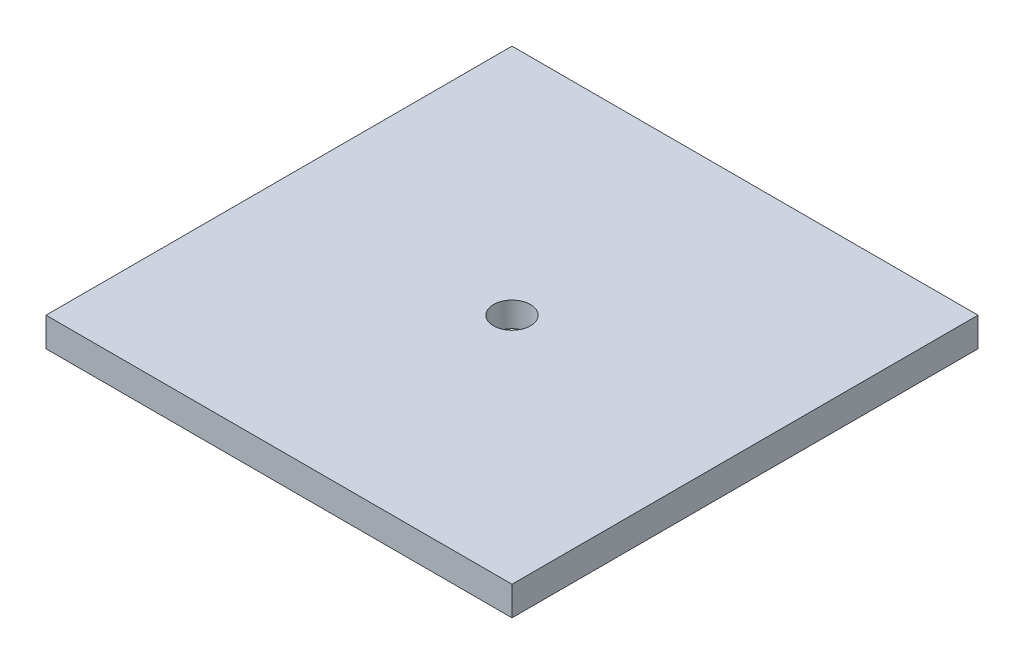
ISO-10303-21;
HEADER;
FILE_DESCRIPTION(('STEP AP214'),'2;1');
FILE_NAME('part.step','',(''),(''),'','','');
FILE_SCHEMA(('AUTOMOTIVE_DESIGN { 1 0 10303 214 1 1 1 1 }'));
ENDSEC;
DATA;
#1=APPLICATION_CONTEXT('core data for automotive mechanical design processes');
#2=APPLICATION_PROTOCOL_DEFINITION('international standard','automotive_design',2000,#1);
#3=PRODUCT_CONTEXT('',#1,'mechanical');
#4=PRODUCT('Part','Part','',(#3));
#5=PRODUCT_RELATED_PRODUCT_CATEGORY('part','',(#4));
#6=PRODUCT_DEFINITION_FORMATION('','',#4);
#7=PRODUCT_DEFINITION_CONTEXT('part definition',#1,'design');
#8=PRODUCT_DEFINITION('design','',#6,#7);
#9=PRODUCT_DEFINITION_SHAPE('','',#8);
#10=(LENGTH_UNIT() NAMED_UNIT(*) SI_UNIT(.MILLI.,.METRE.));
#11=(NAMED_UNIT(*) PLANE_ANGLE_UNIT() SI_UNIT($,.RADIAN.));
#12=(NAMED_UNIT(*) SI_UNIT($,.STERADIAN.) SOLID_ANGLE_UNIT());
#13=UNCERTAINTY_MEASURE_WITH_UNIT(LENGTH_MEASURE(1.E-05),#10,'distance_accuracy_value','');
#14=(GEOMETRIC_REPRESENTATION_CONTEXT(3) GLOBAL_UNCERTAINTY_ASSIGNED_CONTEXT((#13)) GLOBAL_UNIT_ASSIGNED_CONTEXT((#10,
#11,#12)) REPRESENTATION_CONTEXT('',''));
#15=CARTESIAN_POINT('',(0.,0.,0.));
#16=DIRECTION('',(0.,0.,1.));
#17=DIRECTION('',(1.,0.,0.));
#18=AXIS2_PLACEMENT_3D('',#15,#16,#17);
#19=CARTESIAN_POINT('',(101.6,12.7,-101.6));
#20=DIRECTION('',(-1.,0.,0.));
#21=DIRECTION('',(0.,0.,1.));
#22=AXIS2_PLACEMENT_3D('',#19,#20,#21);
#23=PLANE('',#22);
#24=DIRECTION('',(0.,0.,-1.));
#25=VECTOR('',#24,1.);
#26=CARTESIAN_POINT('',(101.6,0.,-101.6));
#27=LINE('',#26,#25);
#28=CARTESIAN_POINT('',(101.6,0.,101.6));
#29=VERTEX_POINT('',#28);
#30=CARTESIAN_POINT('',(101.6,0.,-101.6));
#31=VERTEX_POINT('',#30);
#32=EDGE_CURVE('E111',#29,#31,#27,.T.);
#33=ORIENTED_EDGE('',*,*,#32,.T.);
#34=DIRECTION('',(0.,-1.,0.));
#35=VECTOR('',#34,1.);
#36=CARTESIAN_POINT('',(101.6,12.7,-101.6));
#37=LINE('',#36,#35);
#38=CARTESIAN_POINT('',(101.6,12.7,-101.6));
#39=VERTEX_POINT('',#38);
#40=EDGE_CURVE('E11',#39,#31,#37,.T.);
#41=ORIENTED_EDGE('',*,*,#40,.F.);
#42=DIRECTION('',(0.,0.,-1.));
#43=VECTOR('',#42,1.);
#44=CARTESIAN_POINT('',(101.6,12.7,-101.6));
#45=LINE('',#44,#43);
#46=CARTESIAN_POINT('',(101.6,12.7,101.6));
#47=VERTEX_POINT('',#46);
#48=EDGE_CURVE('E95',#47,#39,#45,.T.);
#49=ORIENTED_EDGE('',*,*,#48,.F.);
#50=DIRECTION('',(0.,-1.,0.));
#51=VECTOR('',#50,1.);
#52=CARTESIAN_POINT('',(101.6,12.7,101.6));
#53=LINE('',#52,#51);
#54=EDGE_CURVE('E107',#47,#29,#53,.T.);
#55=ORIENTED_EDGE('',*,*,#54,.T.);
#56=EDGE_LOOP('',(#33,#41,#49,#55));
#57=FACE_BOUND('',#56,.T.);
#58=ADVANCED_FACE('F43',(#57),#23,.F.);
#59=CARTESIAN_POINT('',(-101.6,12.7,-101.6));
#60=DIRECTION('',(0.,0.,1.));
#61=DIRECTION('',(1.,0.,0.));
#62=AXIS2_PLACEMENT_3D('',#59,#60,#61);
#63=PLANE('',#62);
#64=DIRECTION('',(-1.,0.,0.));
#65=VECTOR('',#64,1.);
#66=CARTESIAN_POINT('',(-101.6,0.,-101.6));
#67=LINE('',#66,#65);
#68=CARTESIAN_POINT('',(-101.6,0.,-101.6));
#69=VERTEX_POINT('',#68);
#70=EDGE_CURVE('E100',#31,#69,#67,.T.);
#71=ORIENTED_EDGE('',*,*,#70,.T.);
#72=DIRECTION('',(0.,-1.,0.));
#73=VECTOR('',#72,1.);
#74=CARTESIAN_POINT('',(-101.6,12.7,-101.6));
#75=LINE('',#74,#73);
#76=CARTESIAN_POINT('',(-101.6,12.7,-101.6));
#77=VERTEX_POINT('',#76);
#78=EDGE_CURVE('E52',#77,#69,#75,.T.);
#79=ORIENTED_EDGE('',*,*,#78,.F.);
#80=DIRECTION('',(-1.,0.,0.));
#81=VECTOR('',#80,1.);
#82=CARTESIAN_POINT('',(-101.6,12.7,-101.6));
#83=LINE('',#82,#81);
#84=EDGE_CURVE('E90',#39,#77,#83,.T.);
#85=ORIENTED_EDGE('',*,*,#84,.F.);
#86=ORIENTED_EDGE('',*,*,#40,.T.);
#87=EDGE_LOOP('',(#71,#79,#85,#86));
#88=FACE_BOUND('',#87,.T.);
#89=ADVANCED_FACE('F99',(#88),#63,.F.);
#90=CARTESIAN_POINT('',(-101.6,12.7,-101.6));
#91=DIRECTION('',(1.,0.,0.));
#92=DIRECTION('',(0.,0.,-1.));
#93=AXIS2_PLACEMENT_3D('',#90,#91,#92);
#94=PLANE('',#93);
#95=DIRECTION('',(0.,0.,1.));
#96=VECTOR('',#95,1.);
#97=CARTESIAN_POINT('',(-101.6,0.,-101.6));
#98=LINE('',#97,#96);
#99=CARTESIAN_POINT('',(-101.6,0.,101.6));
#100=VERTEX_POINT('',#99);
#101=EDGE_CURVE('E77',#69,#100,#98,.T.);
#102=ORIENTED_EDGE('',*,*,#101,.T.);
#103=DIRECTION('',(0.,-1.,0.));
#104=VECTOR('',#103,1.);
#105=CARTESIAN_POINT('',(-101.6,12.7,101.6));
#106=LINE('',#105,#104);
#107=CARTESIAN_POINT('',(-101.6,12.7,101.6));
#108=VERTEX_POINT('',#107);
#109=EDGE_CURVE('E102',#108,#100,#106,.T.);
#110=ORIENTED_EDGE('',*,*,#109,.F.);
#111=DIRECTION('',(0.,0.,1.));
#112=VECTOR('',#111,1.);
#113=CARTESIAN_POINT('',(-101.6,12.7,-101.6));
#114=LINE('',#113,#112);
#115=EDGE_CURVE('E93',#77,#108,#114,.T.);
#116=ORIENTED_EDGE('',*,*,#115,.F.);
#117=ORIENTED_EDGE('',*,*,#78,.T.);
#118=EDGE_LOOP('',(#102,#110,#116,#117));
#119=FACE_BOUND('',#118,.T.);
#120=ADVANCED_FACE('F103',(#119),#94,.F.);
#121=CARTESIAN_POINT('',(-101.6,12.7,101.6));
#122=DIRECTION('',(0.,0.,-1.));
#123=DIRECTION('',(-1.,0.,0.));
#124=AXIS2_PLACEMENT_3D('',#121,#122,#123);
#125=PLANE('',#124);
#126=DIRECTION('',(1.,0.,0.));
#127=VECTOR('',#126,1.);
#128=CARTESIAN_POINT('',(-101.6,0.,101.6));
#129=LINE('',#128,#127);
#130=EDGE_CURVE('E83',#100,#29,#129,.T.);
#131=ORIENTED_EDGE('',*,*,#130,.T.);
#132=ORIENTED_EDGE('',*,*,#54,.F.);
#133=DIRECTION('',(1.,0.,0.));
#134=VECTOR('',#133,1.);
#135=CARTESIAN_POINT('',(-101.6,12.7,101.6));
#136=LINE('',#135,#134);
#137=EDGE_CURVE('E60',#108,#47,#136,.T.);
#138=ORIENTED_EDGE('',*,*,#137,.F.);
#139=ORIENTED_EDGE('',*,*,#109,.T.);
#140=EDGE_LOOP('',(#131,#132,#138,#139));
#141=FACE_BOUND('',#140,.T.);
#142=ADVANCED_FACE('F125',(#141),#125,.F.);
#143=CARTESIAN_POINT('',(0.,12.7,0.));
#144=DIRECTION('',(0.,1.,0.));
#145=DIRECTION('',(0.,0.,1.));
#146=AXIS2_PLACEMENT_3D('',#143,#144,#145);
#147=PLANE('',#146);
#148=CARTESIAN_POINT('',(0.,12.7,0.));
#149=DIRECTION('',(0.,1.,0.));
#150=DIRECTION('',(0.,0.,1.));
#151=AXIS2_PLACEMENT_3D('',#148,#149,#150);
#152=CIRCLE('',#151,8.0645);
#153=CARTESIAN_POINT('',(0.,12.7,8.0645));
#154=VERTEX_POINT('',#153);
#155=EDGE_CURVE('E132',#154,#154,#152,.T.);
#156=ORIENTED_EDGE('',*,*,#155,.F.);
#157=EDGE_LOOP('',(#156));
#158=FACE_BOUND('',#157,.T.);
#159=ORIENTED_EDGE('',*,*,#48,.T.);
#160=ORIENTED_EDGE('',*,*,#84,.T.);
#161=ORIENTED_EDGE('',*,*,#115,.T.);
#162=ORIENTED_EDGE('',*,*,#137,.T.);
#163=EDGE_LOOP('',(#159,#160,#161,#162));
#164=FACE_BOUND('',#163,.T.);
#165=ADVANCED_FACE('F91',(#158,#164),#147,.T.);
#166=CARTESIAN_POINT('',(0.,0.,0.));
#167=DIRECTION('',(0.,1.,0.));
#168=DIRECTION('',(0.,0.,1.));
#169=AXIS2_PLACEMENT_3D('',#166,#167,#168);
#170=PLANE('',#169);
#171=ORIENTED_EDGE('',*,*,#32,.F.);
#172=ORIENTED_EDGE('',*,*,#130,.F.);
#173=ORIENTED_EDGE('',*,*,#101,.F.);
#174=ORIENTED_EDGE('',*,*,#70,.F.);
#175=EDGE_LOOP('',(#171,#172,#173,#174));
#176=FACE_BOUND('',#175,.T.);
#177=ADVANCED_FACE('F128',(#176),#170,.F.);
#178=CARTESIAN_POINT('',(0.,1.905,0.));
#179=DIRECTION('',(0.,1.,0.));
#180=DIRECTION('',(0.,0.,1.));
#181=AXIS2_PLACEMENT_3D('',#178,#179,#180);
#182=CYLINDRICAL_SURFACE('',#181,8.0645);
#183=CARTESIAN_POINT('',(0.,1.905,0.));
#184=DIRECTION('',(0.,1.,0.));
#185=DIRECTION('',(0.,0.,1.));
#186=AXIS2_PLACEMENT_3D('',#183,#184,#185);
#187=CIRCLE('',#186,8.0645);
#188=CARTESIAN_POINT('',(0.,1.905,8.0645));
#189=VERTEX_POINT('',#188);
#190=EDGE_CURVE('E115',#189,#189,#187,.T.);
#191=ORIENTED_EDGE('',*,*,#190,.F.);
#192=EDGE_LOOP('',(#191));
#193=FACE_BOUND('',#192,.T.);
#194=ORIENTED_EDGE('',*,*,#155,.T.);
#195=EDGE_LOOP('',(#194));
#196=FACE_BOUND('',#195,.T.);
#197=ADVANCED_FACE('F142',(#193,#196),#182,.F.);
#198=CARTESIAN_POINT('',(0.,1.905,0.));
#199=DIRECTION('',(0.,1.,0.));
#200=DIRECTION('',(0.,0.,1.));
#201=AXIS2_PLACEMENT_3D('',#198,#199,#200);
#202=PLANE('',#201);
#203=ORIENTED_EDGE('',*,*,#190,.T.);
#204=EDGE_LOOP('',(#203));
#205=FACE_BOUND('',#204,.T.);
#206=ADVANCED_FACE('F140',(#205),#202,.T.);
#207=CLOSED_SHELL('',(#58,#89,#120,#142,#165,#177,#197,#206));
#208=MANIFOLD_SOLID_BREP('B2',#207);
#209=ADVANCED_BREP_SHAPE_REPRESENTATION('',(#18,#208),#14);
#210=SHAPE_DEFINITION_REPRESENTATION(#9,#209);
ENDSEC;
END-ISO-10303-21;
